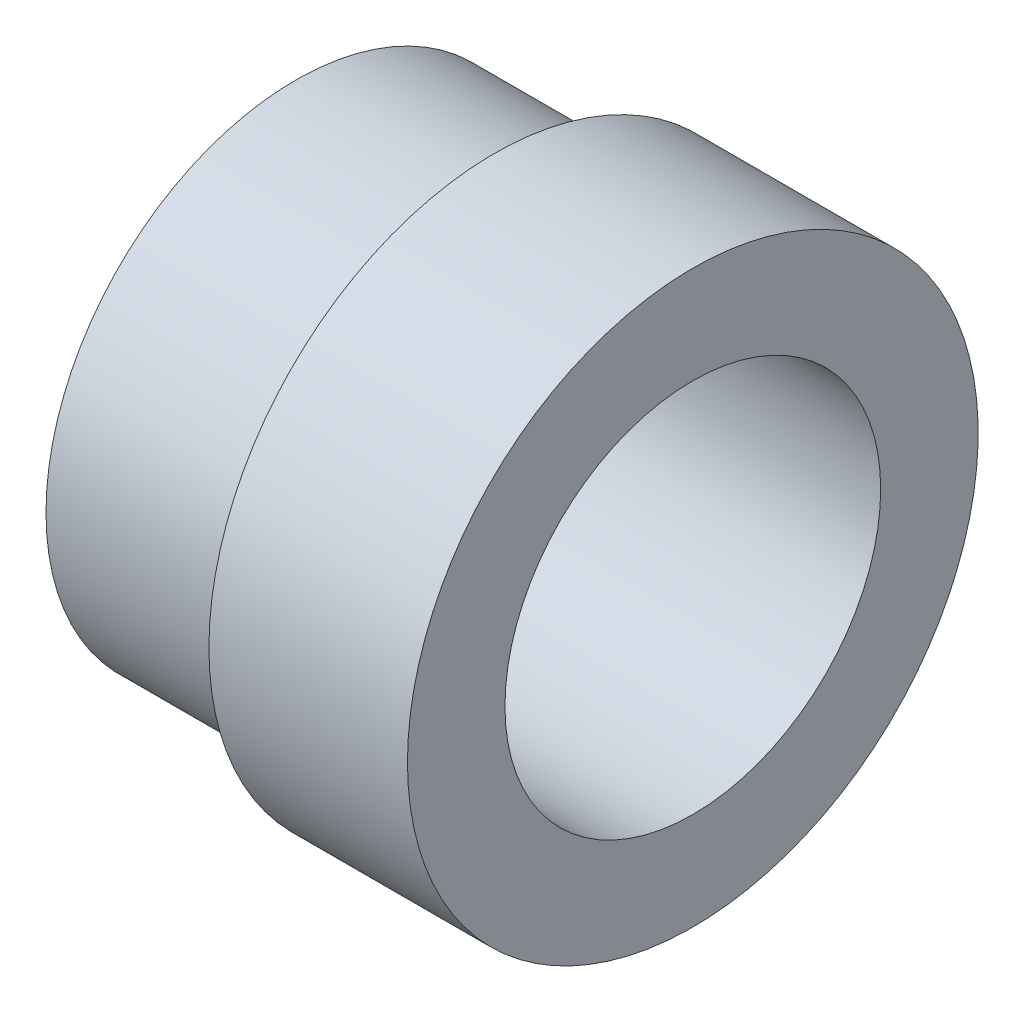
ISO-10303-21;
HEADER;
FILE_DESCRIPTION(('STEP AP214'),'2;1');
FILE_NAME('part.step','',(''),(''),'','','');
FILE_SCHEMA(('AUTOMOTIVE_DESIGN { 1 0 10303 214 1 1 1 1 }'));
ENDSEC;
DATA;
#1=APPLICATION_CONTEXT('core data for automotive mechanical design processes');
#2=APPLICATION_PROTOCOL_DEFINITION('international standard','automotive_design',2000,#1);
#3=PRODUCT_CONTEXT('',#1,'mechanical');
#4=PRODUCT('Part','Part','',(#3));
#5=PRODUCT_RELATED_PRODUCT_CATEGORY('part','',(#4));
#6=PRODUCT_DEFINITION_FORMATION('','',#4);
#7=PRODUCT_DEFINITION_CONTEXT('part definition',#1,'design');
#8=PRODUCT_DEFINITION('design','',#6,#7);
#9=PRODUCT_DEFINITION_SHAPE('','',#8);
#10=(LENGTH_UNIT() NAMED_UNIT(*) SI_UNIT(.MILLI.,.METRE.));
#11=(NAMED_UNIT(*) PLANE_ANGLE_UNIT() SI_UNIT($,.RADIAN.));
#12=(NAMED_UNIT(*) SI_UNIT($,.STERADIAN.) SOLID_ANGLE_UNIT());
#13=UNCERTAINTY_MEASURE_WITH_UNIT(LENGTH_MEASURE(1.E-05),#10,'distance_accuracy_value','');
#14=(GEOMETRIC_REPRESENTATION_CONTEXT(3) GLOBAL_UNCERTAINTY_ASSIGNED_CONTEXT((#13)) GLOBAL_UNIT_ASSIGNED_CONTEXT((#10,
#11,#12)) REPRESENTATION_CONTEXT('',''));
#15=CARTESIAN_POINT('',(0.,0.,0.));
#16=DIRECTION('',(0.,0.,1.));
#17=DIRECTION('',(1.,0.,0.));
#18=AXIS2_PLACEMENT_3D('',#15,#16,#17);
#19=CARTESIAN_POINT('',(-98.0499999999999,-99.5000000000001,-1.52655665885959E-13));
#20=DIRECTION('',(1.,0.,0.));
#21=DIRECTION('',(0.,0.,-1.));
#22=AXIS2_PLACEMENT_3D('',#19,#20,#21);
#23=PLANE('',#22);
#24=CARTESIAN_POINT('',(-98.0499999999999,-110.,-1.80411241501588E-13));
#25=DIRECTION('',(-1.,0.,0.));
#26=DIRECTION('',(0.,0.,1.));
#27=AXIS2_PLACEMENT_3D('',#24,#25,#26);
#28=CIRCLE('',#27,10.5);
#29=CARTESIAN_POINT('',(-98.0499999999999,-110.,10.4999999999998));
#30=VERTEX_POINT('',#29);
#31=EDGE_CURVE('E69',#30,#30,#28,.T.);
#32=ORIENTED_EDGE('',*,*,#31,.F.);
#33=EDGE_LOOP('',(#32));
#34=FACE_BOUND('',#33,.T.);
#35=CARTESIAN_POINT('',(-98.0499999999999,-110.,-1.80411241501588E-13));
#36=DIRECTION('',(-1.,0.,0.));
#37=DIRECTION('',(0.,0.,1.));
#38=AXIS2_PLACEMENT_3D('',#35,#36,#37);
#39=CIRCLE('',#38,12.);
#40=CARTESIAN_POINT('',(-98.0499999999999,-110.,11.9999999999998));
#41=VERTEX_POINT('',#40);
#42=EDGE_CURVE('E12',#41,#41,#39,.T.);
#43=ORIENTED_EDGE('',*,*,#42,.T.);
#44=EDGE_LOOP('',(#43));
#45=FACE_BOUND('',#44,.T.);
#46=ADVANCED_FACE('F47',(#34,#45),#23,.F.);
#47=CARTESIAN_POINT('',(-106.751905161062,-110.,-1.80411241501588E-13));
#48=DIRECTION('',(-1.,0.,0.));
#49=DIRECTION('',(0.,0.,1.));
#50=AXIS2_PLACEMENT_3D('',#47,#48,#49);
#51=CYLINDRICAL_SURFACE('',#50,12.);
#52=ORIENTED_EDGE('',*,*,#42,.F.);
#53=EDGE_LOOP('',(#52));
#54=FACE_BOUND('',#53,.T.);
#55=CARTESIAN_POINT('',(-89.7,-110.,-1.80411241501588E-13));
#56=DIRECTION('',(-1.,0.,0.));
#57=DIRECTION('',(0.,0.,1.));
#58=AXIS2_PLACEMENT_3D('',#55,#56,#57);
#59=CIRCLE('',#58,12.);
#60=CARTESIAN_POINT('',(-89.7,-110.,11.9999999999998));
#61=VERTEX_POINT('',#60);
#62=EDGE_CURVE('E53',#61,#61,#59,.T.);
#63=ORIENTED_EDGE('',*,*,#62,.T.);
#64=EDGE_LOOP('',(#63));
#65=FACE_BOUND('',#64,.T.);
#66=ADVANCED_FACE('F76',(#54,#65),#51,.T.);
#67=CARTESIAN_POINT('',(-89.7,-98.0000000000002,-1.52655665885959E-13));
#68=DIRECTION('',(-1.,0.,0.));
#69=DIRECTION('',(0.,0.,1.));
#70=AXIS2_PLACEMENT_3D('',#67,#68,#69);
#71=PLANE('',#70);
#72=ORIENTED_EDGE('',*,*,#62,.F.);
#73=EDGE_LOOP('',(#72));
#74=FACE_BOUND('',#73,.T.);
#75=CARTESIAN_POINT('',(-89.7,-110.,-1.80411241501588E-13));
#76=DIRECTION('',(-1.,0.,0.));
#77=DIRECTION('',(0.,0.,1.));
#78=AXIS2_PLACEMENT_3D('',#75,#76,#77);
#79=CIRCLE('',#78,7.9);
#80=CARTESIAN_POINT('',(-89.7,-110.,7.89999999999984));
#81=VERTEX_POINT('',#80);
#82=EDGE_CURVE('E57',#81,#81,#79,.T.);
#83=ORIENTED_EDGE('',*,*,#82,.T.);
#84=EDGE_LOOP('',(#83));
#85=FACE_BOUND('',#84,.T.);
#86=ADVANCED_FACE('F80',(#74,#85),#71,.F.);
#87=CARTESIAN_POINT('',(-106.751905161062,-110.,-1.80411241501588E-13));
#88=DIRECTION('',(-1.,0.,0.));
#89=DIRECTION('',(0.,0.,1.));
#90=AXIS2_PLACEMENT_3D('',#87,#88,#89);
#91=CYLINDRICAL_SURFACE('',#90,7.9);
#92=ORIENTED_EDGE('',*,*,#82,.F.);
#93=EDGE_LOOP('',(#92));
#94=FACE_BOUND('',#93,.T.);
#95=CARTESIAN_POINT('',(-106.4,-110.,-1.80411241501588E-13));
#96=DIRECTION('',(-1.,0.,0.));
#97=DIRECTION('',(0.,0.,1.));
#98=AXIS2_PLACEMENT_3D('',#95,#96,#97);
#99=CIRCLE('',#98,7.9);
#100=CARTESIAN_POINT('',(-106.4,-110.,7.89999999999984));
#101=VERTEX_POINT('',#100);
#102=EDGE_CURVE('E61',#101,#101,#99,.T.);
#103=ORIENTED_EDGE('',*,*,#102,.T.);
#104=EDGE_LOOP('',(#103));
#105=FACE_BOUND('',#104,.T.);
#106=ADVANCED_FACE('F85',(#94,#105),#91,.F.);
#107=CARTESIAN_POINT('',(-106.4,-102.1,-1.38777878078145E-13));
#108=DIRECTION('',(1.,0.,0.));
#109=DIRECTION('',(0.,0.,-1.));
#110=AXIS2_PLACEMENT_3D('',#107,#108,#109);
#111=PLANE('',#110);
#112=ORIENTED_EDGE('',*,*,#102,.F.);
#113=EDGE_LOOP('',(#112));
#114=FACE_BOUND('',#113,.T.);
#115=CARTESIAN_POINT('',(-106.4,-110.,-1.80411241501588E-13));
#116=DIRECTION('',(-1.,0.,0.));
#117=DIRECTION('',(0.,0.,1.));
#118=AXIS2_PLACEMENT_3D('',#115,#116,#117);
#119=CIRCLE('',#118,10.5);
#120=CARTESIAN_POINT('',(-106.4,-110.,10.4999999999998));
#121=VERTEX_POINT('',#120);
#122=EDGE_CURVE('E66',#121,#121,#119,.T.);
#123=ORIENTED_EDGE('',*,*,#122,.T.);
#124=EDGE_LOOP('',(#123));
#125=FACE_BOUND('',#124,.T.);
#126=ADVANCED_FACE('F91',(#114,#125),#111,.F.);
#127=CARTESIAN_POINT('',(-106.751905161062,-110.,-1.80411241501588E-13));
#128=DIRECTION('',(-1.,0.,0.));
#129=DIRECTION('',(0.,0.,1.));
#130=AXIS2_PLACEMENT_3D('',#127,#128,#129);
#131=CYLINDRICAL_SURFACE('',#130,10.5);
#132=ORIENTED_EDGE('',*,*,#122,.F.);
#133=EDGE_LOOP('',(#132));
#134=FACE_BOUND('',#133,.T.);
#135=ORIENTED_EDGE('',*,*,#31,.T.);
#136=EDGE_LOOP('',(#135));
#137=FACE_BOUND('',#136,.T.);
#138=ADVANCED_FACE('F73',(#134,#137),#131,.T.);
#139=CLOSED_SHELL('',(#46,#66,#86,#106,#126,#138));
#140=MANIFOLD_SOLID_BREP('B2',#139);
#141=ADVANCED_BREP_SHAPE_REPRESENTATION('',(#18,#140),#14);
#142=SHAPE_DEFINITION_REPRESENTATION(#9,#141);
ENDSEC;
END-ISO-10303-21;
